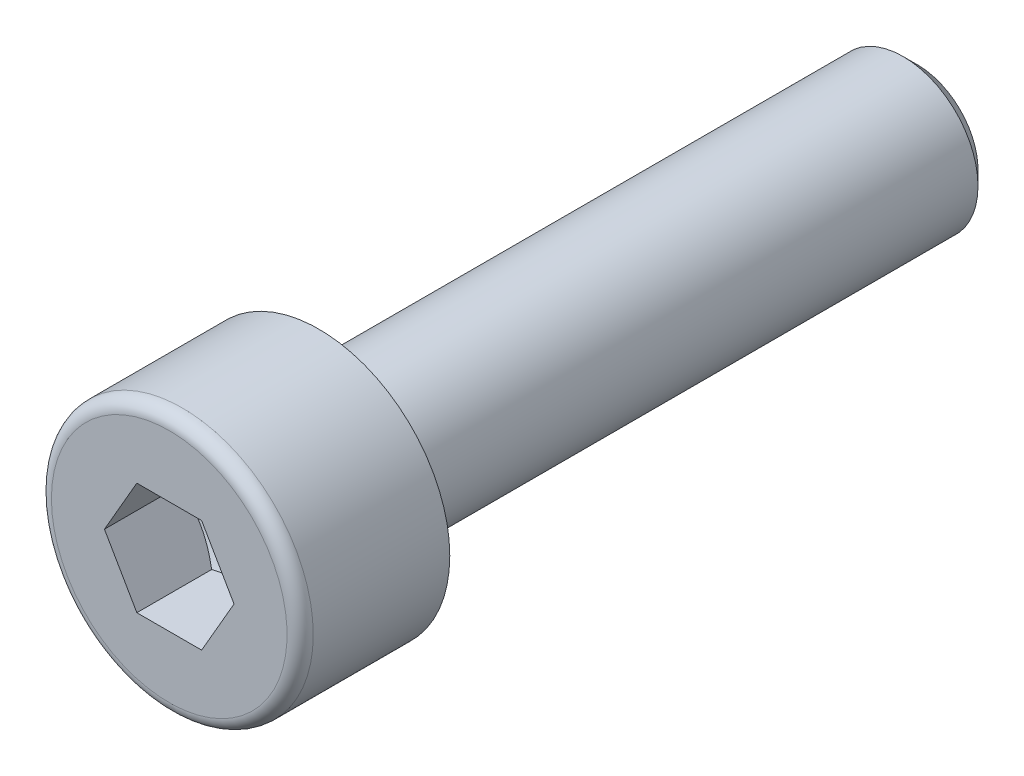
ISO-10303-21;
HEADER;
FILE_DESCRIPTION(('STEP AP214'),'2;1');
FILE_NAME('part.step','',(''),(''),'','','');
FILE_SCHEMA(('AUTOMOTIVE_DESIGN { 1 0 10303 214 1 1 1 1 }'));
ENDSEC;
DATA;
#1=APPLICATION_CONTEXT('core data for automotive mechanical design processes');
#2=APPLICATION_PROTOCOL_DEFINITION('international standard','automotive_design',2000,#1);
#3=PRODUCT_CONTEXT('',#1,'mechanical');
#4=PRODUCT('Part','Part','',(#3));
#5=PRODUCT_RELATED_PRODUCT_CATEGORY('part','',(#4));
#6=PRODUCT_DEFINITION_FORMATION('','',#4);
#7=PRODUCT_DEFINITION_CONTEXT('part definition',#1,'design');
#8=PRODUCT_DEFINITION('design','',#6,#7);
#9=PRODUCT_DEFINITION_SHAPE('','',#8);
#10=(LENGTH_UNIT() NAMED_UNIT(*) SI_UNIT(.MILLI.,.METRE.));
#11=(NAMED_UNIT(*) PLANE_ANGLE_UNIT() SI_UNIT($,.RADIAN.));
#12=(NAMED_UNIT(*) SI_UNIT($,.STERADIAN.) SOLID_ANGLE_UNIT());
#13=UNCERTAINTY_MEASURE_WITH_UNIT(LENGTH_MEASURE(1.E-05),#10,'distance_accuracy_value','');
#14=(GEOMETRIC_REPRESENTATION_CONTEXT(3) GLOBAL_UNCERTAINTY_ASSIGNED_CONTEXT((#13)) GLOBAL_UNIT_ASSIGNED_CONTEXT((#10,
#11,#12)) REPRESENTATION_CONTEXT('',''));
#15=CARTESIAN_POINT('',(0.,0.,0.));
#16=DIRECTION('',(0.,0.,1.));
#17=DIRECTION('',(1.,0.,0.));
#18=AXIS2_PLACEMENT_3D('',#15,#16,#17);
#19=CARTESIAN_POINT('',(0.,0.,0.));
#20=DIRECTION('',(0.,0.,1.));
#21=DIRECTION('',(1.,0.,0.));
#22=AXIS2_PLACEMENT_3D('',#19,#20,#21);
#23=PLANE('',#22);
#24=CARTESIAN_POINT('',(0.,0.,0.));
#25=DIRECTION('',(0.,0.,1.));
#26=DIRECTION('',(1.,0.,0.));
#27=AXIS2_PLACEMENT_3D('',#24,#25,#26);
#28=CIRCLE('',#27,3.5);
#29=CARTESIAN_POINT('',(3.5,0.,0.));
#30=VERTEX_POINT('',#29);
#31=EDGE_CURVE('E146',#30,#30,#28,.T.);
#32=ORIENTED_EDGE('',*,*,#31,.F.);
#33=EDGE_LOOP('',(#32));
#34=FACE_BOUND('',#33,.T.);
#35=CARTESIAN_POINT('',(0.,0.,0.));
#36=DIRECTION('',(0.,0.,1.));
#37=DIRECTION('',(1.,0.,0.));
#38=AXIS2_PLACEMENT_3D('',#35,#36,#37);
#39=CIRCLE('',#38,2.);
#40=CARTESIAN_POINT('',(2.,0.,0.));
#41=VERTEX_POINT('',#40);
#42=EDGE_CURVE('E151',#41,#41,#39,.F.);
#43=ORIENTED_EDGE('',*,*,#42,.F.);
#44=EDGE_LOOP('',(#43));
#45=FACE_BOUND('',#44,.T.);
#46=ADVANCED_FACE('F43',(#34,#45),#23,.F.);
#47=CARTESIAN_POINT('',(0.,3.15,4.));
#48=DIRECTION('',(0.,0.,-1.));
#49=DIRECTION('',(-1.,0.,0.));
#50=AXIS2_PLACEMENT_3D('',#47,#48,#49);
#51=PLANE('',#50);
#52=CARTESIAN_POINT('',(0.,0.,4.));
#53=DIRECTION('',(0.,0.,-1.));
#54=DIRECTION('',(-1.,0.,0.));
#55=AXIS2_PLACEMENT_3D('',#52,#53,#54);
#56=CIRCLE('',#55,3.15);
#57=CARTESIAN_POINT('',(-3.15,0.,4.));
#58=VERTEX_POINT('',#57);
#59=EDGE_CURVE('E51',#58,#58,#56,.F.);
#60=ORIENTED_EDGE('',*,*,#59,.T.);
#61=EDGE_LOOP('',(#60));
#62=FACE_BOUND('',#61,.T.);
#63=DIRECTION('',(0.5,-0.866025403784438,0.));
#64=VECTOR('',#63,1.);
#65=CARTESIAN_POINT('',(0.866025,1.49999930062484,4.));
#66=LINE('',#65,#64);
#67=CARTESIAN_POINT('',(0.866025,1.49999930062484,4.));
#68=VERTEX_POINT('',#67);
#69=CARTESIAN_POINT('',(1.73205,0.,4.));
#70=VERTEX_POINT('',#69);
#71=EDGE_CURVE('E58',#68,#70,#66,.T.);
#72=ORIENTED_EDGE('',*,*,#71,.T.);
#73=DIRECTION('',(-0.5,-0.866025403784439,0.));
#74=VECTOR('',#73,1.);
#75=CARTESIAN_POINT('',(1.73205,0.,4.));
#76=LINE('',#75,#74);
#77=CARTESIAN_POINT('',(0.866025,-1.49999930062484,4.));
#78=VERTEX_POINT('',#77);
#79=EDGE_CURVE('E175',#70,#78,#76,.T.);
#80=ORIENTED_EDGE('',*,*,#79,.T.);
#81=DIRECTION('',(-1.,0.,0.));
#82=VECTOR('',#81,1.);
#83=CARTESIAN_POINT('',(0.866025,-1.49999930062484,4.));
#84=LINE('',#83,#82);
#85=CARTESIAN_POINT('',(-0.866025,-1.49999930062484,4.));
#86=VERTEX_POINT('',#85);
#87=EDGE_CURVE('E271',#78,#86,#84,.T.);
#88=ORIENTED_EDGE('',*,*,#87,.T.);
#89=DIRECTION('',(-0.5,0.866025403784439,0.));
#90=VECTOR('',#89,1.);
#91=CARTESIAN_POINT('',(-0.866025,-1.49999930062484,4.));
#92=LINE('',#91,#90);
#93=CARTESIAN_POINT('',(-1.73205,0.,4.));
#94=VERTEX_POINT('',#93);
#95=EDGE_CURVE('E275',#86,#94,#92,.T.);
#96=ORIENTED_EDGE('',*,*,#95,.T.);
#97=DIRECTION('',(0.5,0.866025403784439,0.));
#98=VECTOR('',#97,1.);
#99=CARTESIAN_POINT('',(-1.73205,0.,4.));
#100=LINE('',#99,#98);
#101=CARTESIAN_POINT('',(-0.866025,1.49999930062484,4.));
#102=VERTEX_POINT('',#101);
#103=EDGE_CURVE('E130',#94,#102,#100,.T.);
#104=ORIENTED_EDGE('',*,*,#103,.T.);
#105=DIRECTION('',(1.,0.,0.));
#106=VECTOR('',#105,1.);
#107=CARTESIAN_POINT('',(-0.866025,1.49999930062484,4.));
#108=LINE('',#107,#106);
#109=EDGE_CURVE('E122',#102,#68,#108,.T.);
#110=ORIENTED_EDGE('',*,*,#109,.T.);
#111=EDGE_LOOP('',(#72,#80,#88,#96,#104,#110));
#112=FACE_BOUND('',#111,.T.);
#113=ADVANCED_FACE('F230',(#62,#112),#51,.F.);
#114=CARTESIAN_POINT('',(0.,0.,4.));
#115=DIRECTION('',(0.,0.,1.));
#116=DIRECTION('',(1.,0.,0.));
#117=AXIS2_PLACEMENT_3D('',#114,#115,#116);
#118=CYLINDRICAL_SURFACE('',#117,3.5);
#119=CARTESIAN_POINT('',(0.,0.,3.65));
#120=DIRECTION('',(0.,0.,-1.));
#121=DIRECTION('',(-1.,0.,0.));
#122=AXIS2_PLACEMENT_3D('',#119,#120,#121);
#123=CIRCLE('',#122,3.5);
#124=CARTESIAN_POINT('',(-3.5,0.,3.65));
#125=VERTEX_POINT('',#124);
#126=EDGE_CURVE('E12',#125,#125,#123,.T.);
#127=ORIENTED_EDGE('',*,*,#126,.T.);
#128=EDGE_LOOP('',(#127));
#129=FACE_BOUND('',#128,.T.);
#130=ORIENTED_EDGE('',*,*,#31,.T.);
#131=EDGE_LOOP('',(#130));
#132=FACE_BOUND('',#131,.T.);
#133=ADVANCED_FACE('F228',(#129,#132),#118,.T.);
#134=CARTESIAN_POINT('',(0.866025,1.49999930062484,1.00000046625011));
#135=DIRECTION('',(-0.866025403784438,-0.5,0.));
#136=DIRECTION('',(-0.5,0.866025403784438,0.));
#137=AXIS2_PLACEMENT_3D('',#134,#135,#136);
#138=PLANE('',#137);
#139=DIRECTION('',(0.,0.,1.));
#140=VECTOR('',#139,1.);
#141=CARTESIAN_POINT('',(1.73205,0.,1.00000046625011));
#142=LINE('',#141,#140);
#143=CARTESIAN_POINT('',(1.73205,0.,2.));
#144=VERTEX_POINT('',#143);
#145=EDGE_CURVE('E143',#144,#70,#142,.T.);
#146=ORIENTED_EDGE('',*,*,#145,.T.);
#147=ORIENTED_EDGE('',*,*,#71,.F.);
#148=DIRECTION('',(0.,0.,1.));
#149=VECTOR('',#148,1.);
#150=CARTESIAN_POINT('',(0.866025,1.49999930062484,1.00000046625011));
#151=LINE('',#150,#149);
#152=CARTESIAN_POINT('',(0.866025,1.49999930062484,2.));
#153=VERTEX_POINT('',#152);
#154=EDGE_CURVE('E115',#153,#68,#151,.T.);
#155=ORIENTED_EDGE('',*,*,#154,.F.);
#156=CARTESIAN_POINT('',(1.73205115470054,-2.E-06,2.00000066666734));
#157=CARTESIAN_POINT('',(1.69399458130122,0.0659139186895892,1.97802228100261));
#158=CARTESIAN_POINT('',(1.65560950414464,0.132398822577242,1.95803408114054));
#159=CARTESIAN_POINT('',(1.57817473630843,0.266519774741864,1.92314525941874));
#160=CARTESIAN_POINT('',(1.53912367019894,0.334158205333232,1.90825697858766));
#161=CARTESIAN_POINT('',(1.46150547885139,0.468596856338784,1.88508226983918));
#162=CARTESIAN_POINT('',(1.42295029290091,0.535376397300293,1.87664158385231));
#163=CARTESIAN_POINT('',(1.34565859846878,0.669249539059823,1.86656700525616));
#164=CARTESIAN_POINT('',(1.30692237073331,0.736342653591208,1.86492476807133));
#165=CARTESIAN_POINT('',(1.23454773253413,0.861699204131607,1.86834969801067));
#166=CARTESIAN_POINT('',(1.20089846229767,0.919981449818777,1.87257593125167));
#167=CARTESIAN_POINT('',(1.1338191361032,1.03616625092508,1.88596796669928));
#168=CARTESIAN_POINT('',(1.10038931198579,1.09406840478452,1.89513833923059));
#169=CARTESIAN_POINT('',(1.03317179328088,1.21049256234014,1.91806252128818));
#170=CARTESIAN_POINT('',(0.999392601793287,1.26899983823525,1.93191346069662));
#171=CARTESIAN_POINT('',(0.932337893068965,1.38514200063251,1.96334924731355));
#172=CARTESIAN_POINT('',(0.89906151743008,1.4427783739308,1.980926712986));
#173=CARTESIAN_POINT('',(0.866023845299461,1.50000130062484,2.00000066666734));
#174=B_SPLINE_CURVE_WITH_KNOTS('',3,(#156,#157,#158,#159,#160,#161,#162,#163,#164,#165,#166,
#167,#168,#169,#170,#171,#172,#173),.UNSPECIFIED.,.F.,.F.,(4,2,2,2,2,2,2,2,4),(0.,
0.237762055931485,0.476095461361748,0.708530837844131,0.94068083294838,1.14278193102308,
1.34507017093339,1.55184422617205,1.75821246569164),.UNSPECIFIED.);
#175=EDGE_CURVE('E107',#144,#153,#174,.T.);
#176=ORIENTED_EDGE('',*,*,#175,.F.);
#177=EDGE_LOOP('',(#146,#147,#155,#176));
#178=FACE_BOUND('',#177,.T.);
#179=ADVANCED_FACE('F116',(#178),#138,.T.);
#180=CARTESIAN_POINT('',(1.73205,0.,1.00000046625011));
#181=DIRECTION('',(-0.866025403784439,0.5,0.));
#182=DIRECTION('',(0.5,0.866025403784439,0.));
#183=AXIS2_PLACEMENT_3D('',#180,#181,#182);
#184=PLANE('',#183);
#185=DIRECTION('',(0.,0.,1.));
#186=VECTOR('',#185,1.);
#187=CARTESIAN_POINT('',(0.866025,-1.49999930062484,1.00000046625011));
#188=LINE('',#187,#186);
#189=CARTESIAN_POINT('',(0.866025,-1.49999930062484,2.));
#190=VERTEX_POINT('',#189);
#191=EDGE_CURVE('E140',#190,#78,#188,.T.);
#192=ORIENTED_EDGE('',*,*,#191,.T.);
#193=ORIENTED_EDGE('',*,*,#79,.F.);
#194=ORIENTED_EDGE('',*,*,#145,.F.);
#195=CARTESIAN_POINT('',(0.866023845299462,-1.50000130062484,2.00000066666734));
#196=CARTESIAN_POINT('',(0.904080418698778,-1.43408538193525,1.9780222810026));
#197=CARTESIAN_POINT('',(0.942465495855361,-1.36760047804759,1.95803408114054));
#198=CARTESIAN_POINT('',(1.01990026369157,-1.23347952588297,1.92314525941874));
#199=CARTESIAN_POINT('',(1.05895132980106,-1.1658410952916,1.90825697858766));
#200=CARTESIAN_POINT('',(1.13656952114861,-1.03140244428605,1.88508226983918));
#201=CARTESIAN_POINT('',(1.1751247070991,-0.964622903324544,1.87664158385231));
#202=CARTESIAN_POINT('',(1.25241640153122,-0.830749761565014,1.86656700525616));
#203=CARTESIAN_POINT('',(1.29115262926669,-0.763656647033629,1.86492476807133));
#204=CARTESIAN_POINT('',(1.36352726746587,-0.638300096493229,1.86834969801067));
#205=CARTESIAN_POINT('',(1.39717653770233,-0.58001785080606,1.87257593125166));
#206=CARTESIAN_POINT('',(1.4642558638968,-0.463833049699756,1.88596796669928));
#207=CARTESIAN_POINT('',(1.49768568801421,-0.405930895840313,1.89513833923059));
#208=CARTESIAN_POINT('',(1.56490320671912,-0.2895067382847,1.91806252128818));
#209=CARTESIAN_POINT('',(1.59868239820671,-0.230999462389588,1.93191346069662));
#210=CARTESIAN_POINT('',(1.66573710693103,-0.11485729999233,1.96334924731355));
#211=CARTESIAN_POINT('',(1.69901348256992,-0.0572209266940348,1.980926712986));
#212=CARTESIAN_POINT('',(1.73205115470054,1.99999999979098E-06,2.00000066666734));
#213=B_SPLINE_CURVE_WITH_KNOTS('',3,(#195,#196,#197,#198,#199,#200,#201,#202,#203,#204,#205,
#206,#207,#208,#209,#210,#211,#212),.UNSPECIFIED.,.F.,.F.,(4,2,2,2,2,2,2,2,4),(0.,
0.237762055931484,0.476095461361747,0.708530837844129,0.940680832948377,1.14278193102307,
1.34507017093338,1.55184422617205,1.75821246569164),.UNSPECIFIED.);
#214=EDGE_CURVE('E111',#190,#144,#213,.T.);
#215=ORIENTED_EDGE('',*,*,#214,.F.);
#216=EDGE_LOOP('',(#192,#193,#194,#215));
#217=FACE_BOUND('',#216,.T.);
#218=ADVANCED_FACE('F219',(#217),#184,.T.);
#219=CARTESIAN_POINT('',(0.866025,-1.49999930062484,1.00000046625011));
#220=DIRECTION('',(0.,1.,0.));
#221=DIRECTION('',(1.,0.,0.));
#222=AXIS2_PLACEMENT_3D('',#219,#220,#221);
#223=PLANE('',#222);
#224=DIRECTION('',(0.,0.,1.));
#225=VECTOR('',#224,1.);
#226=CARTESIAN_POINT('',(-0.866025,-1.49999930062484,1.00000046625011));
#227=LINE('',#226,#225);
#228=CARTESIAN_POINT('',(-0.866025,-1.49999930062484,2.));
#229=VERTEX_POINT('',#228);
#230=EDGE_CURVE('E137',#229,#86,#227,.T.);
#231=ORIENTED_EDGE('',*,*,#230,.T.);
#232=ORIENTED_EDGE('',*,*,#87,.F.);
#233=ORIENTED_EDGE('',*,*,#191,.F.);
#234=CARTESIAN_POINT('',(-2.24271663728987,-1.49999930062484,2.55775267344395));
#235=CARTESIAN_POINT('',(-2.17794141332338,-1.49999930062484,2.52667596135368));
#236=CARTESIAN_POINT('',(-2.11300852130655,-1.49999930062484,2.49592211621229));
#237=CARTESIAN_POINT('',(-1.98274303131292,-1.49999930062484,2.43524311162405));
#238=CARTESIAN_POINT('',(-1.91741036395219,-1.49999930062484,2.40531810131238));
#239=CARTESIAN_POINT('',(-1.78588635397686,-1.49999930062484,2.34631254095844));
#240=CARTESIAN_POINT('',(-1.71969220663993,-1.49999930062484,2.31723821458641));
#241=CARTESIAN_POINT('',(-1.58674953026847,-1.49999930062484,2.26039396688304));
#242=CARTESIAN_POINT('',(-1.52000103027226,-1.49999930062484,2.23262397772829));
#243=CARTESIAN_POINT('',(-1.38408036083489,-1.49999930062484,2.17802545642731));
#244=CARTESIAN_POINT('',(-1.31489044686774,-1.49999930062484,2.1512405113674));
#245=CARTESIAN_POINT('',(-1.17568875836751,-1.49999930062484,2.09990652822181));
#246=CARTESIAN_POINT('',(-1.10567688208708,-1.49999930062484,2.07535777031023));
#247=CARTESIAN_POINT('',(-0.894522216300188,-1.49999930062484,2.0061010834001));
#248=CARTESIAN_POINT('',(-0.751873977094198,-1.49999930062484,1.9656202744164));
#249=CARTESIAN_POINT('',(-0.535047450977606,-1.49999930062484,1.9186645261203));
#250=CARTESIAN_POINT('',(-0.462365424606466,-1.49999930062484,1.90531291688069));
#251=CARTESIAN_POINT('',(-0.316183762847225,-1.49999930062484,1.8841134767258));
#252=CARTESIAN_POINT('',(-0.242684183051902,-1.49999930062484,1.87626527388084));
#253=CARTESIAN_POINT('',(-0.0961588910059515,-1.49999930062484,1.86679859934064));
#254=CARTESIAN_POINT('',(-0.0231380525234333,-1.49999930062484,1.86510661239957));
#255=CARTESIAN_POINT('',(0.122783022434076,-1.49999930062484,1.86789948707645));
#256=CARTESIAN_POINT('',(0.195683251161583,-1.49999930062484,1.8723847311637));
#257=CARTESIAN_POINT('',(0.375553746438775,-1.49999930062484,1.89067768491976));
#258=CARTESIAN_POINT('',(0.4821754471692,-1.49999930062484,1.90791354190592));
#259=CARTESIAN_POINT('',(0.693345462539466,-1.49999930062484,1.95235984396466));
#260=CARTESIAN_POINT('',(0.79789111749796,-1.49999930062484,1.97958231080908));
#261=CARTESIAN_POINT('',(0.954250638010105,-1.49999930062484,2.02608493590371));
#262=CARTESIAN_POINT('',(1.00687274480645,-1.49999930062484,2.04274751774646));
#263=CARTESIAN_POINT('',(1.11156919647057,-1.49999930062484,2.07761406562061));
#264=CARTESIAN_POINT('',(1.16364386068557,-1.49999930062484,2.09581706970924));
#265=CARTESIAN_POINT('',(1.26731501755411,-1.49999930062484,2.13350010092581));
#266=CARTESIAN_POINT('',(1.31891159517315,-1.49999930062484,2.15297989597396));
#267=CARTESIAN_POINT('',(1.42169818698628,-1.49999930062484,2.19300580386973));
#268=CARTESIAN_POINT('',(1.47288813079445,-1.49999930062484,2.21355209687612));
#269=CARTESIAN_POINT('',(1.6035520536722,-1.49999930062484,2.26731329701247));
#270=CARTESIAN_POINT('',(1.68276476914258,-1.49999930062484,2.30116251352867));
#271=CARTESIAN_POINT('',(1.84047488481565,-1.49999930062484,2.37049266735));
#272=CARTESIAN_POINT('',(1.9189722309026,-1.49999930062484,2.40597372689195));
#273=CARTESIAN_POINT('',(2.15362957255391,-1.49999930062484,2.51428942992019));
#274=CARTESIAN_POINT('',(2.3089286607519,-1.49999930062484,2.58898549353906));
#275=CARTESIAN_POINT('',(2.61820006623532,-1.49999930062484,2.74151036059574));
#276=CARTESIAN_POINT('',(2.77217051778771,-1.49999930062484,2.81934290231597));
#277=CARTESIAN_POINT('',(3.07905650209162,-1.49999930062484,2.97700931547993));
#278=CARTESIAN_POINT('',(3.23197216581148,-1.49999930062484,3.05684293253984));
#279=CARTESIAN_POINT('',(3.52267476728495,-1.49999930062484,3.21028853935711));
#280=CARTESIAN_POINT('',(3.66052737206612,-1.49999930062484,3.28377655462836));
#281=CARTESIAN_POINT('',(3.93578914881928,-1.49999930062484,3.43158990958268));
#282=CARTESIAN_POINT('',(4.07319830413762,-1.49999930062484,3.50591528025237));
#283=CARTESIAN_POINT('',(4.34732590427536,-1.49999930062483,3.65500351537988));
#284=CARTESIAN_POINT('',(4.48404521696312,-1.49999930062483,3.72976478622522));
#285=CARTESIAN_POINT('',(4.75720742747683,-1.49999930062483,3.87977391809883));
#286=CARTESIAN_POINT('',(4.89365033939364,-1.49999930062484,3.9550217534582));
#287=CARTESIAN_POINT('',(5.02999394665514,-1.49999930062484,4.03044801324502));
#288=B_SPLINE_CURVE_WITH_KNOTS('',3,(#234,#235,#236,#237,#238,#239,#240,#241,#242,#243,#244,
#245,#246,#247,#248,#249,#250,#251,#252,#253,#254,#255,#256,#257,#258,#259,#260,#261,#262,#263,
#264,#265,#266,#267,#268,#269,#270,#271,#272,#273,#274,#275,#276,#277,#278,#279,#280,#281,#282,
#283,#284,#285,#286,#287),.UNSPECIFIED.,.F.,.F.,(4,2,2,2,2,2,2,2,2,2,2,2,2,2,2,2,2,2,2,2,2,2,2,
2,2,2,4),(0.,0.215535408976475,0.431109351318747,0.647990972858705,0.864861304394723,
1.08740082372431,1.30996818700982,1.75384735851117,1.97537373294937,2.19688513480997,
2.41574248382684,2.63461338422016,2.95796620171825,3.28170955197757,3.44728283297626,
3.61275347131505,3.77819411534645,3.94366279806486,4.20206179692704,4.46048018336434,
4.97740230798824,5.49495989978084,6.01245202818902,6.48110050133562,6.94976637432356,
7.41724019162004,7.88468954517039),.UNSPECIFIED.);
#289=EDGE_CURVE('E208',#229,#190,#288,.T.);
#290=ORIENTED_EDGE('',*,*,#289,.F.);
#291=EDGE_LOOP('',(#231,#232,#233,#290));
#292=FACE_BOUND('',#291,.T.);
#293=ADVANCED_FACE('F215',(#292),#223,.T.);
#294=CARTESIAN_POINT('',(-0.866025,-1.49999930062484,1.00000046625011));
#295=DIRECTION('',(0.866025403784439,0.5,0.));
#296=DIRECTION('',(0.5,-0.866025403784439,0.));
#297=AXIS2_PLACEMENT_3D('',#294,#295,#296);
#298=PLANE('',#297);
#299=DIRECTION('',(0.,0.,1.));
#300=VECTOR('',#299,1.);
#301=CARTESIAN_POINT('',(-1.73205,0.,1.00000046625011));
#302=LINE('',#301,#300);
#303=CARTESIAN_POINT('',(-1.73205,0.,2.));
#304=VERTEX_POINT('',#303);
#305=EDGE_CURVE('E128',#304,#94,#302,.T.);
#306=ORIENTED_EDGE('',*,*,#305,.T.);
#307=ORIENTED_EDGE('',*,*,#95,.F.);
#308=ORIENTED_EDGE('',*,*,#230,.F.);
#309=CARTESIAN_POINT('',(-1.73205115470054,1.99999999935948E-06,2.00000066666734));
#310=CARTESIAN_POINT('',(-1.69399458130122,-0.0659139186895897,1.97802228100261));
#311=CARTESIAN_POINT('',(-1.65560950414464,-0.132398822577242,1.95803408114054));
#312=CARTESIAN_POINT('',(-1.57817473630843,-0.266519774741865,1.92314525941874));
#313=CARTESIAN_POINT('',(-1.53912367019894,-0.334158205333233,1.90825697858766));
#314=CARTESIAN_POINT('',(-1.46150547885139,-0.468596856338785,1.88508226983918));
#315=CARTESIAN_POINT('',(-1.4229502929009,-0.535376397300293,1.87664158385231));
#316=CARTESIAN_POINT('',(-1.34565859846878,-0.669249539059823,1.86656700525616));
#317=CARTESIAN_POINT('',(-1.30692237073331,-0.736342653591209,1.86492476807133));
#318=CARTESIAN_POINT('',(-1.23454773253413,-0.861699204131608,1.86834969801067));
#319=CARTESIAN_POINT('',(-1.20089846229767,-0.919981449818777,1.87257593125166));
#320=CARTESIAN_POINT('',(-1.1338191361032,-1.03616625092508,1.88596796669928));
#321=CARTESIAN_POINT('',(-1.10038931198579,-1.09406840478452,1.89513833923059));
#322=CARTESIAN_POINT('',(-1.03317179328088,-1.21049256234014,1.91806252128818));
#323=CARTESIAN_POINT('',(-0.999392601793289,-1.26899983823525,1.93191346069662));
#324=CARTESIAN_POINT('',(-0.932337893068967,-1.38514200063251,1.96334924731355));
#325=CARTESIAN_POINT('',(-0.899061517430081,-1.4427783739308,1.980926712986));
#326=CARTESIAN_POINT('',(-0.866023845299461,-1.50000130062484,2.00000066666734));
#327=B_SPLINE_CURVE_WITH_KNOTS('',3,(#309,#310,#311,#312,#313,#314,#315,#316,#317,#318,#319,
#320,#321,#322,#323,#324,#325,#326),.UNSPECIFIED.,.F.,.F.,(4,2,2,2,2,2,2,2,4),(0.,
0.237762055931485,0.476095461361749,0.708530837844132,0.94068083294838,1.14278193102308,
1.34507017093338,1.55184422617205,1.75821246569164),.UNSPECIFIED.);
#328=EDGE_CURVE('E202',#304,#229,#327,.T.);
#329=ORIENTED_EDGE('',*,*,#328,.F.);
#330=EDGE_LOOP('',(#306,#307,#308,#329));
#331=FACE_BOUND('',#330,.T.);
#332=ADVANCED_FACE('F218',(#331),#298,.T.);
#333=CARTESIAN_POINT('',(-1.73205,0.,1.00000046625011));
#334=DIRECTION('',(0.866025403784439,-0.5,0.));
#335=DIRECTION('',(-0.5,-0.866025403784439,0.));
#336=AXIS2_PLACEMENT_3D('',#333,#334,#335);
#337=PLANE('',#336);
#338=DIRECTION('',(0.,0.,1.));
#339=VECTOR('',#338,1.);
#340=CARTESIAN_POINT('',(-0.866025,1.49999930062484,1.00000046625011));
#341=LINE('',#340,#339);
#342=CARTESIAN_POINT('',(-0.866025,1.49999930062484,2.));
#343=VERTEX_POINT('',#342);
#344=EDGE_CURVE('E121',#343,#102,#341,.T.);
#345=ORIENTED_EDGE('',*,*,#344,.T.);
#346=ORIENTED_EDGE('',*,*,#103,.F.);
#347=ORIENTED_EDGE('',*,*,#305,.F.);
#348=CARTESIAN_POINT('',(-0.866023845299462,1.50000130062484,2.00000066666734));
#349=CARTESIAN_POINT('',(-0.904080418698778,1.43408538193525,1.9780222810026));
#350=CARTESIAN_POINT('',(-0.942465495855361,1.36760047804759,1.95803408114054));
#351=CARTESIAN_POINT('',(-1.01990026369157,1.23347952588297,1.92314525941874));
#352=CARTESIAN_POINT('',(-1.05895132980106,1.1658410952916,1.90825697858766));
#353=CARTESIAN_POINT('',(-1.13656952114861,1.03140244428605,1.88508226983918));
#354=CARTESIAN_POINT('',(-1.1751247070991,0.964622903324544,1.87664158385231));
#355=CARTESIAN_POINT('',(-1.25241640153122,0.830749761565014,1.86656700525616));
#356=CARTESIAN_POINT('',(-1.29115262926669,0.763656647033629,1.86492476807133));
#357=CARTESIAN_POINT('',(-1.36352726746587,0.638300096493229,1.86834969801067));
#358=CARTESIAN_POINT('',(-1.39717653770233,0.58001785080606,1.87257593125166));
#359=CARTESIAN_POINT('',(-1.4642558638968,0.463833049699756,1.88596796669928));
#360=CARTESIAN_POINT('',(-1.49768568801421,0.405930895840313,1.89513833923059));
#361=CARTESIAN_POINT('',(-1.56490320671912,0.289506738284699,1.91806252128818));
#362=CARTESIAN_POINT('',(-1.59868239820671,0.230999462389588,1.93191346069662));
#363=CARTESIAN_POINT('',(-1.66573710693103,0.11485729999233,1.96334924731355));
#364=CARTESIAN_POINT('',(-1.69901348256992,0.0572209266940344,1.980926712986));
#365=CARTESIAN_POINT('',(-1.73205115470054,-2.00000000048508E-06,2.00000066666734));
#366=B_SPLINE_CURVE_WITH_KNOTS('',3,(#348,#349,#350,#351,#352,#353,#354,#355,#356,#357,#358,
#359,#360,#361,#362,#363,#364,#365),.UNSPECIFIED.,.F.,.F.,(4,2,2,2,2,2,2,2,4),(0.,
0.237762055931484,0.476095461361747,0.708530837844129,0.940680832948377,1.14278193102307,
1.34507017093338,1.55184422617205,1.75821246569164),.UNSPECIFIED.);
#367=EDGE_CURVE('E66',#343,#304,#366,.T.);
#368=ORIENTED_EDGE('',*,*,#367,.F.);
#369=EDGE_LOOP('',(#345,#346,#347,#368));
#370=FACE_BOUND('',#369,.T.);
#371=ADVANCED_FACE('F297',(#370),#337,.T.);
#372=CARTESIAN_POINT('',(-0.866025,1.49999930062484,1.00000046625011));
#373=DIRECTION('',(0.,-1.,0.));
#374=DIRECTION('',(-1.,0.,0.));
#375=AXIS2_PLACEMENT_3D('',#372,#373,#374);
#376=PLANE('',#375);
#377=ORIENTED_EDGE('',*,*,#154,.T.);
#378=ORIENTED_EDGE('',*,*,#109,.F.);
#379=ORIENTED_EDGE('',*,*,#344,.F.);
#380=CARTESIAN_POINT('',(-2.24271663728987,1.49999930062484,2.55775267344395));
#381=CARTESIAN_POINT('',(-2.17794141332338,1.49999930062484,2.52667596135368));
#382=CARTESIAN_POINT('',(-2.11300852130655,1.49999930062484,2.49592211621229));
#383=CARTESIAN_POINT('',(-1.98274303131292,1.49999930062484,2.43524311162405));
#384=CARTESIAN_POINT('',(-1.91741036395219,1.49999930062484,2.40531810131238));
#385=CARTESIAN_POINT('',(-1.78588635397687,1.49999930062484,2.34631254095844));
#386=CARTESIAN_POINT('',(-1.71969220663993,1.49999930062484,2.31723821458641));
#387=CARTESIAN_POINT('',(-1.58674953026847,1.49999930062484,2.26039396688304));
#388=CARTESIAN_POINT('',(-1.52000103027226,1.49999930062484,2.23262397772829));
#389=CARTESIAN_POINT('',(-1.3840803608349,1.49999930062484,2.17802545642731));
#390=CARTESIAN_POINT('',(-1.31489044686775,1.49999930062484,2.1512405113674));
#391=CARTESIAN_POINT('',(-1.17568875836751,1.49999930062484,2.09990652822181));
#392=CARTESIAN_POINT('',(-1.10567688208708,1.49999930062484,2.07535777031023));
#393=CARTESIAN_POINT('',(-0.894522216300189,1.49999930062484,2.0061010834001));
#394=CARTESIAN_POINT('',(-0.751873977094199,1.49999930062484,1.9656202744164));
#395=CARTESIAN_POINT('',(-0.535047450977607,1.49999930062484,1.9186645261203));
#396=CARTESIAN_POINT('',(-0.462365424606467,1.49999930062484,1.90531291688069));
#397=CARTESIAN_POINT('',(-0.316183762847226,1.49999930062484,1.8841134767258));
#398=CARTESIAN_POINT('',(-0.242684183051903,1.49999930062484,1.87626527388084));
#399=CARTESIAN_POINT('',(-0.0961588910059524,1.49999930062484,1.86679859934064));
#400=CARTESIAN_POINT('',(-0.0231380525234342,1.49999930062484,1.86510661239957));
#401=CARTESIAN_POINT('',(0.122783022434075,1.49999930062484,1.86789948707645));
#402=CARTESIAN_POINT('',(0.195683251161582,1.49999930062484,1.8723847311637));
#403=CARTESIAN_POINT('',(0.375553746438774,1.49999930062484,1.89067768491976));
#404=CARTESIAN_POINT('',(0.482175447169199,1.49999930062484,1.90791354190592));
#405=CARTESIAN_POINT('',(0.693345462539464,1.49999930062484,1.95235984396466));
#406=CARTESIAN_POINT('',(0.797891117497957,1.49999930062484,1.97958231080908));
#407=CARTESIAN_POINT('',(0.954250638010102,1.49999930062484,2.02608493590371));
#408=CARTESIAN_POINT('',(1.00687274480645,1.49999930062484,2.04274751774646));
#409=CARTESIAN_POINT('',(1.11156919647056,1.49999930062484,2.07761406562061));
#410=CARTESIAN_POINT('',(1.16364386068556,1.49999930062484,2.09581706970924));
#411=CARTESIAN_POINT('',(1.2673150175541,1.49999930062484,2.13350010092581));
#412=CARTESIAN_POINT('',(1.31891159517315,1.49999930062484,2.15297989597396));
#413=CARTESIAN_POINT('',(1.42169818698628,1.49999930062484,2.19300580386972));
#414=CARTESIAN_POINT('',(1.47288813079445,1.49999930062484,2.21355209687612));
#415=CARTESIAN_POINT('',(1.60355205367219,1.49999930062484,2.26731329701247));
#416=CARTESIAN_POINT('',(1.68276476914257,1.49999930062484,2.30116251352867));
#417=CARTESIAN_POINT('',(1.84047488481565,1.49999930062484,2.37049266735));
#418=CARTESIAN_POINT('',(1.91897223090259,1.49999930062484,2.40597372689195));
#419=CARTESIAN_POINT('',(2.15362957255391,1.49999930062484,2.51428942992019));
#420=CARTESIAN_POINT('',(2.30892866075189,1.49999930062484,2.58898549353906));
#421=CARTESIAN_POINT('',(2.61820006623532,1.49999930062484,2.74151036059574));
#422=CARTESIAN_POINT('',(2.77217051778771,1.49999930062484,2.81934290231597));
#423=CARTESIAN_POINT('',(3.07905650209162,1.49999930062484,2.97700931547993));
#424=CARTESIAN_POINT('',(3.23197216581148,1.49999930062484,3.05684293253984));
#425=CARTESIAN_POINT('',(3.52267476728495,1.49999930062484,3.21028853935711));
#426=CARTESIAN_POINT('',(3.66052737206611,1.49999930062484,3.28377655462836));
#427=CARTESIAN_POINT('',(3.93578914881928,1.49999930062484,3.43158990958268));
#428=CARTESIAN_POINT('',(4.07319830413762,1.49999930062484,3.50591528025237));
#429=CARTESIAN_POINT('',(4.34732590427536,1.49999930062484,3.65500351537988));
#430=CARTESIAN_POINT('',(4.48404521696312,1.49999930062484,3.72976478622523));
#431=CARTESIAN_POINT('',(4.75720742747683,1.49999930062484,3.87977391809883));
#432=CARTESIAN_POINT('',(4.89365033939364,1.49999930062484,3.9550217534582));
#433=CARTESIAN_POINT('',(5.02999394665514,1.49999930062484,4.03044801324502));
#434=B_SPLINE_CURVE_WITH_KNOTS('',3,(#380,#381,#382,#383,#384,#385,#386,#387,#388,#389,#390,
#391,#392,#393,#394,#395,#396,#397,#398,#399,#400,#401,#402,#403,#404,#405,#406,#407,#408,#409,
#410,#411,#412,#413,#414,#415,#416,#417,#418,#419,#420,#421,#422,#423,#424,#425,#426,#427,#428,
#429,#430,#431,#432,#433),.UNSPECIFIED.,.F.,.F.,(4,2,2,2,2,2,2,2,2,2,2,2,2,2,2,2,2,2,2,2,2,2,2,
2,2,2,4),(0.,0.215535408976474,0.431109351318746,0.647990972858704,0.864861304394721,
1.0874008237243,1.30996818700982,1.75384735851117,1.97537373294937,2.19688513480997,
2.41574248382684,2.63461338422015,2.95796620171825,3.28170955197757,3.44728283297626,
3.61275347131505,3.77819411534645,3.94366279806485,4.20206179692704,4.46048018336433,
4.97740230798824,5.49495989978084,6.01245202818902,6.48110050133561,6.94976637432355,
7.41724019162004,7.88468954517039),.UNSPECIFIED.);
#435=EDGE_CURVE('E108',#153,#343,#434,.F.);
#436=ORIENTED_EDGE('',*,*,#435,.F.);
#437=EDGE_LOOP('',(#377,#378,#379,#436));
#438=FACE_BOUND('',#437,.T.);
#439=ADVANCED_FACE('F103',(#438),#376,.T.);
#440=CARTESIAN_POINT('',(0.,0.,1.00000046625011));
#441=DIRECTION('',(0.,0.,1.));
#442=DIRECTION('',(1.,0.,0.));
#443=AXIS2_PLACEMENT_3D('',#440,#441,#442);
#444=CONICAL_SURFACE('',#443,0.,1.0471975511966);
#445=CARTESIAN_POINT('',(0.,0.,1.00000046625011));
#446=VERTEX_POINT('',#445);
#447=VERTEX_LOOP('',#446);
#448=FACE_BOUND('',#447,.T.);
#449=ORIENTED_EDGE('',*,*,#175,.T.);
#450=ORIENTED_EDGE('',*,*,#435,.T.);
#451=ORIENTED_EDGE('',*,*,#367,.T.);
#452=ORIENTED_EDGE('',*,*,#328,.T.);
#453=ORIENTED_EDGE('',*,*,#289,.T.);
#454=ORIENTED_EDGE('',*,*,#214,.T.);
#455=EDGE_LOOP('',(#449,#450,#451,#452,#453,#454));
#456=FACE_BOUND('',#455,.T.);
#457=ADVANCED_FACE('F99',(#448,#456),#444,.F.);
#458=CARTESIAN_POINT('',(0.,0.,-16.));
#459=DIRECTION('',(0.,0.,1.));
#460=DIRECTION('',(1.,0.,0.));
#461=AXIS2_PLACEMENT_3D('',#458,#459,#460);
#462=CYLINDRICAL_SURFACE('',#461,2.);
#463=CARTESIAN_POINT('',(0.,0.,-15.621125));
#464=DIRECTION('',(0.,0.,-1.));
#465=DIRECTION('',(-1.,0.,0.));
#466=AXIS2_PLACEMENT_3D('',#463,#464,#465);
#467=CIRCLE('',#466,2.);
#468=CARTESIAN_POINT('',(-2.,0.,-15.621125));
#469=VERTEX_POINT('',#468);
#470=EDGE_CURVE('E253',#469,#469,#467,.F.);
#471=ORIENTED_EDGE('',*,*,#470,.T.);
#472=EDGE_LOOP('',(#471));
#473=FACE_BOUND('',#472,.T.);
#474=ORIENTED_EDGE('',*,*,#42,.T.);
#475=EDGE_LOOP('',(#474));
#476=FACE_BOUND('',#475,.T.);
#477=ADVANCED_FACE('F102',(#473,#476),#462,.T.);
#478=CARTESIAN_POINT('',(0.,0.,-16.));
#479=DIRECTION('',(0.,0.,-1.));
#480=DIRECTION('',(-1.,0.,0.));
#481=AXIS2_PLACEMENT_3D('',#478,#479,#480);
#482=PLANE('',#481);
#483=CARTESIAN_POINT('',(0.,0.,-16.));
#484=DIRECTION('',(0.,0.,-1.));
#485=DIRECTION('',(-1.,0.,0.));
#486=AXIS2_PLACEMENT_3D('',#483,#484,#485);
#487=CIRCLE('',#486,1.621125);
#488=CARTESIAN_POINT('',(-1.621125,0.,-16.));
#489=VERTEX_POINT('',#488);
#490=EDGE_CURVE('E256',#489,#489,#487,.T.);
#491=ORIENTED_EDGE('',*,*,#490,.T.);
#492=EDGE_LOOP('',(#491));
#493=FACE_BOUND('',#492,.T.);
#494=ADVANCED_FACE('F242',(#493),#482,.T.);
#495=CARTESIAN_POINT('',(0.,0.,-16.));
#496=DIRECTION('',(0.,0.,1.));
#497=DIRECTION('',(1.,0.,0.));
#498=AXIS2_PLACEMENT_3D('',#495,#496,#497);
#499=CONICAL_SURFACE('',#498,1.621125,0.785398163397448);
#500=ORIENTED_EDGE('',*,*,#470,.F.);
#501=EDGE_LOOP('',(#500));
#502=FACE_BOUND('',#501,.T.);
#503=ORIENTED_EDGE('',*,*,#490,.F.);
#504=EDGE_LOOP('',(#503));
#505=FACE_BOUND('',#504,.T.);
#506=ADVANCED_FACE('F240',(#502,#505),#499,.T.);
#507=CARTESIAN_POINT('',(0.,0.,3.65));
#508=DIRECTION('',(0.,0.,-1.));
#509=DIRECTION('',(-1.,0.,0.));
#510=AXIS2_PLACEMENT_3D('',#507,#508,#509);
#511=TOROIDAL_SURFACE('',#510,3.15,0.35);
#512=ORIENTED_EDGE('',*,*,#126,.F.);
#513=EDGE_LOOP('',(#512));
#514=FACE_BOUND('',#513,.T.);
#515=ORIENTED_EDGE('',*,*,#59,.F.);
#516=EDGE_LOOP('',(#515));
#517=FACE_BOUND('',#516,.T.);
#518=ADVANCED_FACE('F45',(#514,#517),#511,.T.);
#519=CLOSED_SHELL('',(#46,#113,#133,#179,#218,#293,#332,#371,#439,#457,#477,#494,#506,#518));
#520=MANIFOLD_SOLID_BREP('B2',#519);
#521=ADVANCED_BREP_SHAPE_REPRESENTATION('',(#18,#520),#14);
#522=SHAPE_DEFINITION_REPRESENTATION(#9,#521);
ENDSEC;
END-ISO-10303-21;
